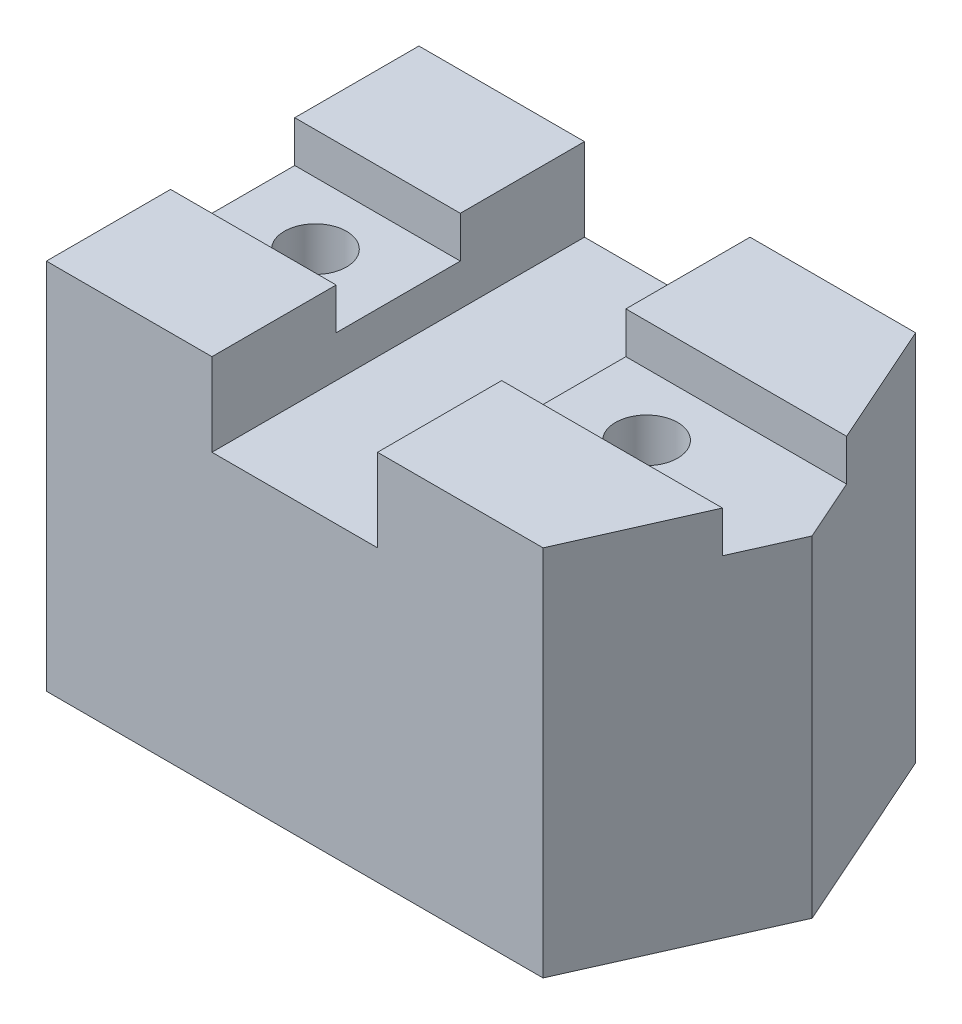
ISO-10303-21;
HEADER;
FILE_DESCRIPTION(('STEP AP214'),'2;1');
FILE_NAME('part.step','',(''),(''),'','','');
FILE_SCHEMA(('AUTOMOTIVE_DESIGN { 1 0 10303 214 1 1 1 1 }'));
ENDSEC;
DATA;
#1=APPLICATION_CONTEXT('core data for automotive mechanical design processes');
#2=APPLICATION_PROTOCOL_DEFINITION('international standard','automotive_design',2000,#1);
#3=PRODUCT_CONTEXT('',#1,'mechanical');
#4=PRODUCT('Part','Part','',(#3));
#5=PRODUCT_RELATED_PRODUCT_CATEGORY('part','',(#4));
#6=PRODUCT_DEFINITION_FORMATION('','',#4);
#7=PRODUCT_DEFINITION_CONTEXT('part definition',#1,'design');
#8=PRODUCT_DEFINITION('design','',#6,#7);
#9=PRODUCT_DEFINITION_SHAPE('','',#8);
#10=(LENGTH_UNIT() NAMED_UNIT(*) SI_UNIT(.MILLI.,.METRE.));
#11=(NAMED_UNIT(*) PLANE_ANGLE_UNIT() SI_UNIT($,.RADIAN.));
#12=(NAMED_UNIT(*) SI_UNIT($,.STERADIAN.) SOLID_ANGLE_UNIT());
#13=UNCERTAINTY_MEASURE_WITH_UNIT(LENGTH_MEASURE(1.E-05),#10,'distance_accuracy_value','');
#14=(GEOMETRIC_REPRESENTATION_CONTEXT(3) GLOBAL_UNCERTAINTY_ASSIGNED_CONTEXT((#13)) GLOBAL_UNIT_ASSIGNED_CONTEXT((#10,
#11,#12)) REPRESENTATION_CONTEXT('',''));
#15=CARTESIAN_POINT('',(0.,0.,0.));
#16=DIRECTION('',(0.,0.,1.));
#17=DIRECTION('',(1.,0.,0.));
#18=AXIS2_PLACEMENT_3D('',#15,#16,#17);
#19=CARTESIAN_POINT('',(0.,114.3,0.));
#20=DIRECTION('',(0.,1.,0.));
#21=DIRECTION('',(0.,0.,1.));
#22=AXIS2_PLACEMENT_3D('',#19,#20,#21);
#23=PLANE('',#22);
#24=DIRECTION('',(0.,0.,1.));
#25=VECTOR('',#24,1.);
#26=CARTESIAN_POINT('',(50.8,114.3,0.));
#27=LINE('',#26,#25);
#28=CARTESIAN_POINT('',(50.8,114.3,-38.1));
#29=VERTEX_POINT('',#28);
#30=CARTESIAN_POINT('',(50.8,114.3,0.));
#31=VERTEX_POINT('',#30);
#32=EDGE_CURVE('E347',#29,#31,#27,.T.);
#33=ORIENTED_EDGE('',*,*,#32,.F.);
#34=DIRECTION('',(1.,0.,0.));
#35=VECTOR('',#34,1.);
#36=CARTESIAN_POINT('',(169.333333333333,114.3,-38.1));
#37=LINE('',#36,#35);
#38=CARTESIAN_POINT('',(0.,114.3,-38.1));
#39=VERTEX_POINT('',#38);
#40=EDGE_CURVE('E228',#39,#29,#37,.T.);
#41=ORIENTED_EDGE('',*,*,#40,.F.);
#42=DIRECTION('',(0.,0.,1.));
#43=VECTOR('',#42,1.);
#44=CARTESIAN_POINT('',(0.,114.3,-114.3));
#45=LINE('',#44,#43);
#46=CARTESIAN_POINT('',(0.,114.3,0.));
#47=VERTEX_POINT('',#46);
#48=EDGE_CURVE('E253',#39,#47,#45,.T.);
#49=ORIENTED_EDGE('',*,*,#48,.T.);
#50=DIRECTION('',(1.,0.,0.));
#51=VECTOR('',#50,1.);
#52=CARTESIAN_POINT('',(0.,114.3,0.));
#53=LINE('',#52,#51);
#54=EDGE_CURVE('E254',#47,#31,#53,.T.);
#55=ORIENTED_EDGE('',*,*,#54,.T.);
#56=EDGE_LOOP('',(#33,#41,#49,#55));
#57=FACE_BOUND('',#56,.T.);
#58=ADVANCED_FACE('F39',(#57),#23,.T.);
#59=CARTESIAN_POINT('',(50.8,114.3,-114.3));
#60=VERTEX_POINT('',#59);
#61=CARTESIAN_POINT('',(50.8,114.3,-76.2));
#62=VERTEX_POINT('',#61);
#63=EDGE_CURVE('E182',#60,#62,#27,.T.);
#64=ORIENTED_EDGE('',*,*,#63,.F.);
#65=DIRECTION('',(-1.,0.,0.));
#66=VECTOR('',#65,1.);
#67=CARTESIAN_POINT('',(152.4,114.3,-114.3));
#68=LINE('',#67,#66);
#69=CARTESIAN_POINT('',(0.,114.3,-114.3));
#70=VERTEX_POINT('',#69);
#71=EDGE_CURVE('E265',#60,#70,#68,.T.);
#72=ORIENTED_EDGE('',*,*,#71,.T.);
#73=CARTESIAN_POINT('',(0.,114.3,-76.2));
#74=VERTEX_POINT('',#73);
#75=EDGE_CURVE('E249',#70,#74,#45,.T.);
#76=ORIENTED_EDGE('',*,*,#75,.T.);
#77=DIRECTION('',(-1.,0.,0.));
#78=VECTOR('',#77,1.);
#79=CARTESIAN_POINT('',(0.,114.3,-76.2));
#80=LINE('',#79,#78);
#81=EDGE_CURVE('E305',#62,#74,#80,.T.);
#82=ORIENTED_EDGE('',*,*,#81,.F.);
#83=EDGE_LOOP('',(#64,#72,#76,#82));
#84=FACE_BOUND('',#83,.T.);
#85=ADVANCED_FACE('F363',(#84),#23,.T.);
#86=CARTESIAN_POINT('',(0.,101.6,0.));
#87=DIRECTION('',(0.,-1.,0.));
#88=DIRECTION('',(0.,0.,-1.));
#89=AXIS2_PLACEMENT_3D('',#86,#87,#88);
#90=PLANE('',#89);
#91=CARTESIAN_POINT('',(25.4,101.6,-57.15));
#92=DIRECTION('',(0.,1.,0.));
#93=DIRECTION('',(0.,0.,1.));
#94=AXIS2_PLACEMENT_3D('',#91,#92,#93);
#95=CIRCLE('',#94,9.525);
#96=CARTESIAN_POINT('',(25.4,101.6,-47.625));
#97=VERTEX_POINT('',#96);
#98=EDGE_CURVE('E401',#97,#97,#95,.T.);
#99=ORIENTED_EDGE('',*,*,#98,.F.);
#100=EDGE_LOOP('',(#99));
#101=FACE_BOUND('',#100,.T.);
#102=DIRECTION('',(1.,0.,0.));
#103=VECTOR('',#102,1.);
#104=CARTESIAN_POINT('',(218.011692498618,101.6,-38.1));
#105=LINE('',#104,#103);
#106=CARTESIAN_POINT('',(0.,101.6,-38.1));
#107=VERTEX_POINT('',#106);
#108=CARTESIAN_POINT('',(50.8,101.6,-38.1));
#109=VERTEX_POINT('',#108);
#110=EDGE_CURVE('E213',#107,#109,#105,.T.);
#111=ORIENTED_EDGE('',*,*,#110,.T.);
#112=DIRECTION('',(0.,0.,-1.));
#113=VECTOR('',#112,1.);
#114=CARTESIAN_POINT('',(50.8,101.6,0.));
#115=LINE('',#114,#113);
#116=CARTESIAN_POINT('',(50.8,101.6,-76.2));
#117=VERTEX_POINT('',#116);
#118=EDGE_CURVE('E204',#109,#117,#115,.T.);
#119=ORIENTED_EDGE('',*,*,#118,.T.);
#120=DIRECTION('',(-1.,0.,0.));
#121=VECTOR('',#120,1.);
#122=CARTESIAN_POINT('',(0.,101.6,-76.2));
#123=LINE('',#122,#121);
#124=CARTESIAN_POINT('',(0.,101.6,-76.2));
#125=VERTEX_POINT('',#124);
#126=EDGE_CURVE('E217',#117,#125,#123,.T.);
#127=ORIENTED_EDGE('',*,*,#126,.T.);
#128=DIRECTION('',(0.,0.,1.));
#129=VECTOR('',#128,1.);
#130=CARTESIAN_POINT('',(0.,101.6,-38.1));
#131=LINE('',#130,#129);
#132=EDGE_CURVE('E223',#125,#107,#131,.T.);
#133=ORIENTED_EDGE('',*,*,#132,.T.);
#134=EDGE_LOOP('',(#111,#119,#127,#133));
#135=FACE_BOUND('',#134,.T.);
#136=ADVANCED_FACE('F389',(#101,#135),#90,.F.);
#137=CARTESIAN_POINT('',(169.333333333333,101.6,-38.1));
#138=DIRECTION('',(0.,0.,1.));
#139=DIRECTION('',(1.,0.,0.));
#140=AXIS2_PLACEMENT_3D('',#137,#138,#139);
#141=PLANE('',#140);
#142=ORIENTED_EDGE('',*,*,#40,.T.);
#143=DIRECTION('',(0.,-1.,0.));
#144=VECTOR('',#143,1.);
#145=CARTESIAN_POINT('',(50.8,101.6,-38.1));
#146=LINE('',#145,#144);
#147=EDGE_CURVE('E208',#29,#109,#146,.T.);
#148=ORIENTED_EDGE('',*,*,#147,.T.);
#149=ORIENTED_EDGE('',*,*,#110,.F.);
#150=DIRECTION('',(0.,1.,0.));
#151=VECTOR('',#150,1.);
#152=CARTESIAN_POINT('',(0.,101.6,-38.1));
#153=LINE('',#152,#151);
#154=EDGE_CURVE('E232',#107,#39,#153,.T.);
#155=ORIENTED_EDGE('',*,*,#154,.T.);
#156=EDGE_LOOP('',(#142,#148,#149,#155));
#157=FACE_BOUND('',#156,.T.);
#158=ADVANCED_FACE('F391',(#157),#141,.F.);
#159=CARTESIAN_POINT('',(0.,101.6,-76.2));
#160=DIRECTION('',(0.,0.,-1.));
#161=DIRECTION('',(-1.,0.,0.));
#162=AXIS2_PLACEMENT_3D('',#159,#160,#161);
#163=PLANE('',#162);
#164=ORIENTED_EDGE('',*,*,#126,.F.);
#165=DIRECTION('',(0.,1.,0.));
#166=VECTOR('',#165,1.);
#167=CARTESIAN_POINT('',(50.8,101.6,-76.2));
#168=LINE('',#167,#166);
#169=EDGE_CURVE('E11',#117,#62,#168,.T.);
#170=ORIENTED_EDGE('',*,*,#169,.T.);
#171=ORIENTED_EDGE('',*,*,#81,.T.);
#172=DIRECTION('',(0.,1.,0.));
#173=VECTOR('',#172,1.);
#174=CARTESIAN_POINT('',(0.,101.6,-76.2));
#175=LINE('',#174,#173);
#176=EDGE_CURVE('E227',#125,#74,#175,.T.);
#177=ORIENTED_EDGE('',*,*,#176,.F.);
#178=EDGE_LOOP('',(#164,#170,#171,#177));
#179=FACE_BOUND('',#178,.T.);
#180=ADVANCED_FACE('F386',(#179),#163,.F.);
#181=DIRECTION('',(0.,0.,-1.));
#182=VECTOR('',#181,1.);
#183=CARTESIAN_POINT('',(101.6,114.3,-114.3));
#184=LINE('',#183,#182);
#185=CARTESIAN_POINT('',(101.6,114.3,0.));
#186=VERTEX_POINT('',#185);
#187=CARTESIAN_POINT('',(101.6,114.3,-38.1));
#188=VERTEX_POINT('',#187);
#189=EDGE_CURVE('E342',#186,#188,#184,.T.);
#190=ORIENTED_EDGE('',*,*,#189,.F.);
#191=CARTESIAN_POINT('',(152.4,114.3,0.));
#192=VERTEX_POINT('',#191);
#193=EDGE_CURVE('E187',#186,#192,#53,.T.);
#194=ORIENTED_EDGE('',*,*,#193,.T.);
#195=DIRECTION('',(0.406138466053447,0.,-0.913811548620257));
#196=VECTOR('',#195,1.);
#197=CARTESIAN_POINT('',(152.4,114.3,0.));
#198=LINE('',#197,#196);
#199=CARTESIAN_POINT('',(169.333333333333,114.3,-38.1));
#200=VERTEX_POINT('',#199);
#201=EDGE_CURVE('E258',#192,#200,#198,.T.);
#202=ORIENTED_EDGE('',*,*,#201,.T.);
#203=EDGE_CURVE('E212',#188,#200,#37,.T.);
#204=ORIENTED_EDGE('',*,*,#203,.F.);
#205=EDGE_LOOP('',(#190,#194,#202,#204));
#206=FACE_BOUND('',#205,.T.);
#207=ADVANCED_FACE('F376',(#206),#23,.T.);
#208=CARTESIAN_POINT('',(0.,114.3,-114.3));
#209=DIRECTION('',(1.,0.,0.));
#210=DIRECTION('',(0.,0.,-1.));
#211=AXIS2_PLACEMENT_3D('',#208,#209,#210);
#212=PLANE('',#211);
#213=ORIENTED_EDGE('',*,*,#48,.F.);
#214=ORIENTED_EDGE('',*,*,#154,.F.);
#215=ORIENTED_EDGE('',*,*,#132,.F.);
#216=ORIENTED_EDGE('',*,*,#176,.T.);
#217=ORIENTED_EDGE('',*,*,#75,.F.);
#218=DIRECTION('',(0.,-1.,0.));
#219=VECTOR('',#218,1.);
#220=CARTESIAN_POINT('',(0.,114.3,-114.3));
#221=LINE('',#220,#219);
#222=CARTESIAN_POINT('',(0.,0.,-114.3));
#223=VERTEX_POINT('',#222);
#224=EDGE_CURVE('E270',#70,#223,#221,.T.);
#225=ORIENTED_EDGE('',*,*,#224,.T.);
#226=DIRECTION('',(0.,0.,1.));
#227=VECTOR('',#226,1.);
#228=CARTESIAN_POINT('',(0.,0.,-114.3));
#229=LINE('',#228,#227);
#230=CARTESIAN_POINT('',(0.,0.,0.));
#231=VERTEX_POINT('',#230);
#232=EDGE_CURVE('E248',#223,#231,#229,.T.);
#233=ORIENTED_EDGE('',*,*,#232,.T.);
#234=DIRECTION('',(0.,-1.,0.));
#235=VECTOR('',#234,1.);
#236=CARTESIAN_POINT('',(0.,114.3,0.));
#237=LINE('',#236,#235);
#238=EDGE_CURVE('E301',#47,#231,#237,.T.);
#239=ORIENTED_EDGE('',*,*,#238,.F.);
#240=EDGE_LOOP('',(#213,#214,#215,#216,#217,#225,#233,#239));
#241=FACE_BOUND('',#240,.T.);
#242=ADVANCED_FACE('F41',(#241),#212,.F.);
#243=CARTESIAN_POINT('',(0.,114.3,0.));
#244=DIRECTION('',(0.,0.,-1.));
#245=DIRECTION('',(-1.,0.,0.));
#246=AXIS2_PLACEMENT_3D('',#243,#244,#245);
#247=PLANE('',#246);
#248=DIRECTION('',(1.,0.,0.));
#249=VECTOR('',#248,1.);
#250=CARTESIAN_POINT('',(101.6,88.9,0.));
#251=LINE('',#250,#249);
#252=CARTESIAN_POINT('',(50.8,88.9,0.));
#253=VERTEX_POINT('',#252);
#254=CARTESIAN_POINT('',(101.6,88.9,0.));
#255=VERTEX_POINT('',#254);
#256=EDGE_CURVE('E172',#253,#255,#251,.T.);
#257=ORIENTED_EDGE('',*,*,#256,.F.);
#258=DIRECTION('',(0.,1.,0.));
#259=VECTOR('',#258,1.);
#260=CARTESIAN_POINT('',(50.8,88.9,0.));
#261=LINE('',#260,#259);
#262=EDGE_CURVE('E200',#253,#31,#261,.T.);
#263=ORIENTED_EDGE('',*,*,#262,.T.);
#264=ORIENTED_EDGE('',*,*,#54,.F.);
#265=ORIENTED_EDGE('',*,*,#238,.T.);
#266=DIRECTION('',(1.,0.,0.));
#267=VECTOR('',#266,1.);
#268=CARTESIAN_POINT('',(0.,0.,0.));
#269=LINE('',#268,#267);
#270=CARTESIAN_POINT('',(152.4,0.,0.));
#271=VERTEX_POINT('',#270);
#272=EDGE_CURVE('E274',#231,#271,#269,.T.);
#273=ORIENTED_EDGE('',*,*,#272,.T.);
#274=DIRECTION('',(0.,-1.,0.));
#275=VECTOR('',#274,1.);
#276=CARTESIAN_POINT('',(152.4,114.3,0.));
#277=LINE('',#276,#275);
#278=EDGE_CURVE('E297',#192,#271,#277,.T.);
#279=ORIENTED_EDGE('',*,*,#278,.F.);
#280=ORIENTED_EDGE('',*,*,#193,.F.);
#281=DIRECTION('',(0.,1.,0.));
#282=VECTOR('',#281,1.);
#283=CARTESIAN_POINT('',(101.6,88.9,0.));
#284=LINE('',#283,#282);
#285=EDGE_CURVE('E164',#255,#186,#284,.T.);
#286=ORIENTED_EDGE('',*,*,#285,.F.);
#287=EDGE_LOOP('',(#257,#263,#264,#265,#273,#279,#280,#286));
#288=FACE_BOUND('',#287,.T.);
#289=ADVANCED_FACE('F185',(#288),#247,.F.);
#290=CARTESIAN_POINT('',(152.4,114.3,0.));
#291=DIRECTION('',(-0.913811548620257,0.,-0.406138466053447));
#292=DIRECTION('',(-0.406138466053447,0.,0.913811548620257));
#293=AXIS2_PLACEMENT_3D('',#290,#291,#292);
#294=PLANE('',#293);
#295=DIRECTION('',(-0.406138466053447,0.,0.913811548620257));
#296=VECTOR('',#295,1.);
#297=CARTESIAN_POINT('',(152.4,101.6,0.));
#298=LINE('',#297,#296);
#299=CARTESIAN_POINT('',(177.8,101.6,-57.15));
#300=VERTEX_POINT('',#299);
#301=CARTESIAN_POINT('',(169.333333333333,101.6,-38.1));
#302=VERTEX_POINT('',#301);
#303=EDGE_CURVE('E244',#300,#302,#298,.T.);
#304=ORIENTED_EDGE('',*,*,#303,.T.);
#305=DIRECTION('',(0.,1.,0.));
#306=VECTOR('',#305,1.);
#307=CARTESIAN_POINT('',(169.333333333333,114.3,-38.1));
#308=LINE('',#307,#306);
#309=EDGE_CURVE('E240',#302,#200,#308,.T.);
#310=ORIENTED_EDGE('',*,*,#309,.T.);
#311=ORIENTED_EDGE('',*,*,#201,.F.);
#312=ORIENTED_EDGE('',*,*,#278,.T.);
#313=DIRECTION('',(0.406138466053447,0.,-0.913811548620257));
#314=VECTOR('',#313,1.);
#315=CARTESIAN_POINT('',(152.4,0.,0.));
#316=LINE('',#315,#314);
#317=CARTESIAN_POINT('',(177.8,0.,-57.15));
#318=VERTEX_POINT('',#317);
#319=EDGE_CURVE('E277',#271,#318,#316,.T.);
#320=ORIENTED_EDGE('',*,*,#319,.T.);
#321=DIRECTION('',(0.,-1.,0.));
#322=VECTOR('',#321,1.);
#323=CARTESIAN_POINT('',(177.8,114.3,-57.15));
#324=LINE('',#323,#322);
#325=EDGE_CURVE('E294',#300,#318,#324,.T.);
#326=ORIENTED_EDGE('',*,*,#325,.F.);
#327=EDGE_LOOP('',(#304,#310,#311,#312,#320,#326));
#328=FACE_BOUND('',#327,.T.);
#329=ADVANCED_FACE('F324',(#328),#294,.F.);
#330=CARTESIAN_POINT('',(177.8,114.3,-57.15));
#331=DIRECTION('',(-0.913811548620257,0.,0.406138466053447));
#332=DIRECTION('',(0.406138466053447,0.,0.913811548620257));
#333=AXIS2_PLACEMENT_3D('',#330,#331,#332);
#334=PLANE('',#333);
#335=DIRECTION('',(-0.406138466053447,0.,-0.913811548620257));
#336=VECTOR('',#335,1.);
#337=CARTESIAN_POINT('',(177.8,114.3,-57.15));
#338=LINE('',#337,#336);
#339=CARTESIAN_POINT('',(169.333333333333,114.3,-76.2));
#340=VERTEX_POINT('',#339);
#341=CARTESIAN_POINT('',(152.4,114.3,-114.3));
#342=VERTEX_POINT('',#341);
#343=EDGE_CURVE('E262',#340,#342,#338,.T.);
#344=ORIENTED_EDGE('',*,*,#343,.F.);
#345=DIRECTION('',(0.,-1.,0.));
#346=VECTOR('',#345,1.);
#347=CARTESIAN_POINT('',(169.333333333333,114.3,-76.2));
#348=LINE('',#347,#346);
#349=CARTESIAN_POINT('',(169.333333333333,101.6,-76.2));
#350=VERTEX_POINT('',#349);
#351=EDGE_CURVE('E64',#340,#350,#348,.T.);
#352=ORIENTED_EDGE('',*,*,#351,.T.);
#353=DIRECTION('',(0.406138466053447,0.,0.913811548620257));
#354=VECTOR('',#353,1.);
#355=CARTESIAN_POINT('',(177.8,101.6,-57.15));
#356=LINE('',#355,#354);
#357=EDGE_CURVE('E309',#350,#300,#356,.T.);
#358=ORIENTED_EDGE('',*,*,#357,.T.);
#359=ORIENTED_EDGE('',*,*,#325,.T.);
#360=DIRECTION('',(-0.406138466053447,0.,-0.913811548620257));
#361=VECTOR('',#360,1.);
#362=CARTESIAN_POINT('',(177.8,0.,-57.15));
#363=LINE('',#362,#361);
#364=CARTESIAN_POINT('',(152.4,0.,-114.3));
#365=VERTEX_POINT('',#364);
#366=EDGE_CURVE('E281',#318,#365,#363,.T.);
#367=ORIENTED_EDGE('',*,*,#366,.T.);
#368=DIRECTION('',(0.,-1.,0.));
#369=VECTOR('',#368,1.);
#370=CARTESIAN_POINT('',(152.4,114.3,-114.3));
#371=LINE('',#370,#369);
#372=EDGE_CURVE('E290',#342,#365,#371,.T.);
#373=ORIENTED_EDGE('',*,*,#372,.F.);
#374=EDGE_LOOP('',(#344,#352,#358,#359,#367,#373));
#375=FACE_BOUND('',#374,.T.);
#376=ADVANCED_FACE('F322',(#375),#334,.F.);
#377=CARTESIAN_POINT('',(152.4,114.3,-114.3));
#378=DIRECTION('',(0.,0.,1.));
#379=DIRECTION('',(1.,0.,0.));
#380=AXIS2_PLACEMENT_3D('',#377,#378,#379);
#381=PLANE('',#380);
#382=ORIENTED_EDGE('',*,*,#71,.F.);
#383=DIRECTION('',(0.,1.,0.));
#384=VECTOR('',#383,1.);
#385=CARTESIAN_POINT('',(50.8,88.9,-114.3));
#386=LINE('',#385,#384);
#387=CARTESIAN_POINT('',(50.8,88.9,-114.3));
#388=VERTEX_POINT('',#387);
#389=EDGE_CURVE('E192',#388,#60,#386,.T.);
#390=ORIENTED_EDGE('',*,*,#389,.F.);
#391=DIRECTION('',(-1.,0.,0.));
#392=VECTOR('',#391,1.);
#393=CARTESIAN_POINT('',(50.8,88.9,-114.3));
#394=LINE('',#393,#392);
#395=CARTESIAN_POINT('',(101.6,88.9,-114.3));
#396=VERTEX_POINT('',#395);
#397=EDGE_CURVE('E171',#396,#388,#394,.T.);
#398=ORIENTED_EDGE('',*,*,#397,.F.);
#399=DIRECTION('',(0.,1.,0.));
#400=VECTOR('',#399,1.);
#401=CARTESIAN_POINT('',(101.6,88.9,-114.3));
#402=LINE('',#401,#400);
#403=CARTESIAN_POINT('',(101.6,114.3,-114.3));
#404=VERTEX_POINT('',#403);
#405=EDGE_CURVE('E167',#396,#404,#402,.T.);
#406=ORIENTED_EDGE('',*,*,#405,.T.);
#407=EDGE_CURVE('E266',#342,#404,#68,.T.);
#408=ORIENTED_EDGE('',*,*,#407,.F.);
#409=ORIENTED_EDGE('',*,*,#372,.T.);
#410=DIRECTION('',(-1.,0.,0.));
#411=VECTOR('',#410,1.);
#412=CARTESIAN_POINT('',(152.4,0.,-114.3));
#413=LINE('',#412,#411);
#414=EDGE_CURVE('E284',#365,#223,#413,.T.);
#415=ORIENTED_EDGE('',*,*,#414,.T.);
#416=ORIENTED_EDGE('',*,*,#224,.F.);
#417=EDGE_LOOP('',(#382,#390,#398,#406,#408,#409,#415,#416));
#418=FACE_BOUND('',#417,.T.);
#419=ADVANCED_FACE('F336',(#418),#381,.F.);
#420=CARTESIAN_POINT('',(101.6,114.3,-76.2));
#421=VERTEX_POINT('',#420);
#422=EDGE_CURVE('E340',#421,#404,#184,.T.);
#423=ORIENTED_EDGE('',*,*,#422,.F.);
#424=EDGE_CURVE('E306',#340,#421,#80,.T.);
#425=ORIENTED_EDGE('',*,*,#424,.F.);
#426=ORIENTED_EDGE('',*,*,#343,.T.);
#427=ORIENTED_EDGE('',*,*,#407,.T.);
#428=EDGE_LOOP('',(#423,#425,#426,#427));
#429=FACE_BOUND('',#428,.T.);
#430=ADVANCED_FACE('F339',(#429),#23,.T.);
#431=CARTESIAN_POINT('',(0.,0.,0.));
#432=DIRECTION('',(0.,1.,0.));
#433=DIRECTION('',(0.,0.,1.));
#434=AXIS2_PLACEMENT_3D('',#431,#432,#433);
#435=PLANE('',#434);
#436=CARTESIAN_POINT('',(25.4,0.,-57.15));
#437=DIRECTION('',(0.,1.,0.));
#438=DIRECTION('',(0.,0.,1.));
#439=AXIS2_PLACEMENT_3D('',#436,#437,#438);
#440=CIRCLE('',#439,9.525);
#441=CARTESIAN_POINT('',(25.4,0.,-47.625));
#442=VERTEX_POINT('',#441);
#443=EDGE_CURVE('E43',#442,#442,#440,.T.);
#444=ORIENTED_EDGE('',*,*,#443,.T.);
#445=EDGE_LOOP('',(#444));
#446=FACE_BOUND('',#445,.T.);
#447=CARTESIAN_POINT('',(127.,0.,-57.15));
#448=DIRECTION('',(0.,1.,0.));
#449=DIRECTION('',(0.,0.,1.));
#450=AXIS2_PLACEMENT_3D('',#447,#448,#449);
#451=CIRCLE('',#450,9.525);
#452=CARTESIAN_POINT('',(127.,0.,-47.625));
#453=VERTEX_POINT('',#452);
#454=EDGE_CURVE('E343',#453,#453,#451,.T.);
#455=ORIENTED_EDGE('',*,*,#454,.T.);
#456=EDGE_LOOP('',(#455));
#457=FACE_BOUND('',#456,.T.);
#458=ORIENTED_EDGE('',*,*,#232,.F.);
#459=ORIENTED_EDGE('',*,*,#414,.F.);
#460=ORIENTED_EDGE('',*,*,#366,.F.);
#461=ORIENTED_EDGE('',*,*,#319,.F.);
#462=ORIENTED_EDGE('',*,*,#272,.F.);
#463=EDGE_LOOP('',(#458,#459,#460,#461,#462));
#464=FACE_BOUND('',#463,.T.);
#465=ADVANCED_FACE('F331',(#446,#457,#464),#435,.F.);
#466=CARTESIAN_POINT('',(127.,101.6,-57.15));
#467=DIRECTION('',(0.,1.,0.));
#468=DIRECTION('',(0.,0.,1.));
#469=AXIS2_PLACEMENT_3D('',#466,#467,#468);
#470=CIRCLE('',#469,9.525);
#471=CARTESIAN_POINT('',(127.,101.6,-47.625));
#472=VERTEX_POINT('',#471);
#473=EDGE_CURVE('E349',#472,#472,#470,.T.);
#474=ORIENTED_EDGE('',*,*,#473,.F.);
#475=EDGE_LOOP('',(#474));
#476=FACE_BOUND('',#475,.T.);
#477=CARTESIAN_POINT('',(101.6,101.6,-76.2));
#478=VERTEX_POINT('',#477);
#479=EDGE_CURVE('E219',#350,#478,#123,.T.);
#480=ORIENTED_EDGE('',*,*,#479,.T.);
#481=DIRECTION('',(0.,0.,1.));
#482=VECTOR('',#481,1.);
#483=CARTESIAN_POINT('',(101.6,101.6,0.));
#484=LINE('',#483,#482);
#485=CARTESIAN_POINT('',(101.6,101.6,-38.1));
#486=VERTEX_POINT('',#485);
#487=EDGE_CURVE('E56',#478,#486,#484,.T.);
#488=ORIENTED_EDGE('',*,*,#487,.T.);
#489=EDGE_CURVE('E218',#486,#302,#105,.T.);
#490=ORIENTED_EDGE('',*,*,#489,.T.);
#491=ORIENTED_EDGE('',*,*,#303,.F.);
#492=ORIENTED_EDGE('',*,*,#357,.F.);
#493=EDGE_LOOP('',(#480,#488,#490,#491,#492));
#494=FACE_BOUND('',#493,.T.);
#495=ADVANCED_FACE('F317',(#476,#494),#90,.F.);
#496=ORIENTED_EDGE('',*,*,#489,.F.);
#497=DIRECTION('',(0.,1.,0.));
#498=VECTOR('',#497,1.);
#499=CARTESIAN_POINT('',(101.6,101.6,-38.1));
#500=LINE('',#499,#498);
#501=EDGE_CURVE('E199',#486,#188,#500,.T.);
#502=ORIENTED_EDGE('',*,*,#501,.T.);
#503=ORIENTED_EDGE('',*,*,#203,.T.);
#504=ORIENTED_EDGE('',*,*,#309,.F.);
#505=EDGE_LOOP('',(#496,#502,#503,#504));
#506=FACE_BOUND('',#505,.T.);
#507=ADVANCED_FACE('F374',(#506),#141,.F.);
#508=ORIENTED_EDGE('',*,*,#424,.T.);
#509=DIRECTION('',(0.,-1.,0.));
#510=VECTOR('',#509,1.);
#511=CARTESIAN_POINT('',(101.6,101.6,-76.2));
#512=LINE('',#511,#510);
#513=EDGE_CURVE('E49',#421,#478,#512,.T.);
#514=ORIENTED_EDGE('',*,*,#513,.T.);
#515=ORIENTED_EDGE('',*,*,#479,.F.);
#516=ORIENTED_EDGE('',*,*,#351,.F.);
#517=EDGE_LOOP('',(#508,#514,#515,#516));
#518=FACE_BOUND('',#517,.T.);
#519=ADVANCED_FACE('F314',(#518),#163,.F.);
#520=CARTESIAN_POINT('',(50.8,88.9,0.));
#521=DIRECTION('',(-1.,0.,0.));
#522=DIRECTION('',(0.,0.,1.));
#523=AXIS2_PLACEMENT_3D('',#520,#521,#522);
#524=PLANE('',#523);
#525=ORIENTED_EDGE('',*,*,#32,.T.);
#526=ORIENTED_EDGE('',*,*,#262,.F.);
#527=DIRECTION('',(0.,0.,1.));
#528=VECTOR('',#527,1.);
#529=CARTESIAN_POINT('',(50.8,88.9,0.));
#530=LINE('',#529,#528);
#531=EDGE_CURVE('E178',#388,#253,#530,.T.);
#532=ORIENTED_EDGE('',*,*,#531,.F.);
#533=ORIENTED_EDGE('',*,*,#389,.T.);
#534=ORIENTED_EDGE('',*,*,#63,.T.);
#535=ORIENTED_EDGE('',*,*,#169,.F.);
#536=ORIENTED_EDGE('',*,*,#118,.F.);
#537=ORIENTED_EDGE('',*,*,#147,.F.);
#538=EDGE_LOOP('',(#525,#526,#532,#533,#534,#535,#536,#537));
#539=FACE_BOUND('',#538,.T.);
#540=ADVANCED_FACE('F360',(#539),#524,.F.);
#541=CARTESIAN_POINT('',(101.6,88.9,-114.3));
#542=DIRECTION('',(1.,0.,0.));
#543=DIRECTION('',(0.,0.,-1.));
#544=AXIS2_PLACEMENT_3D('',#541,#542,#543);
#545=PLANE('',#544);
#546=ORIENTED_EDGE('',*,*,#487,.F.);
#547=ORIENTED_EDGE('',*,*,#513,.F.);
#548=ORIENTED_EDGE('',*,*,#422,.T.);
#549=ORIENTED_EDGE('',*,*,#405,.F.);
#550=DIRECTION('',(0.,0.,-1.));
#551=VECTOR('',#550,1.);
#552=CARTESIAN_POINT('',(101.6,88.9,-114.3));
#553=LINE('',#552,#551);
#554=EDGE_CURVE('E160',#255,#396,#553,.T.);
#555=ORIENTED_EDGE('',*,*,#554,.F.);
#556=ORIENTED_EDGE('',*,*,#285,.T.);
#557=ORIENTED_EDGE('',*,*,#189,.T.);
#558=ORIENTED_EDGE('',*,*,#501,.F.);
#559=EDGE_LOOP('',(#546,#547,#548,#549,#555,#556,#557,#558));
#560=FACE_BOUND('',#559,.T.);
#561=ADVANCED_FACE('F162',(#560),#545,.F.);
#562=CARTESIAN_POINT('',(0.,88.9,0.));
#563=DIRECTION('',(0.,-1.,0.));
#564=DIRECTION('',(0.,0.,-1.));
#565=AXIS2_PLACEMENT_3D('',#562,#563,#564);
#566=PLANE('',#565);
#567=ORIENTED_EDGE('',*,*,#256,.T.);
#568=ORIENTED_EDGE('',*,*,#554,.T.);
#569=ORIENTED_EDGE('',*,*,#397,.T.);
#570=ORIENTED_EDGE('',*,*,#531,.T.);
#571=EDGE_LOOP('',(#567,#568,#569,#570));
#572=FACE_BOUND('',#571,.T.);
#573=ADVANCED_FACE('F176',(#572),#566,.F.);
#574=CARTESIAN_POINT('',(127.,-2184.4,-57.15));
#575=DIRECTION('',(0.,1.,0.));
#576=DIRECTION('',(0.,0.,1.));
#577=AXIS2_PLACEMENT_3D('',#574,#575,#576);
#578=CYLINDRICAL_SURFACE('',#577,9.525);
#579=ORIENTED_EDGE('',*,*,#473,.T.);
#580=EDGE_LOOP('',(#579));
#581=FACE_BOUND('',#580,.T.);
#582=ORIENTED_EDGE('',*,*,#454,.F.);
#583=EDGE_LOOP('',(#582));
#584=FACE_BOUND('',#583,.T.);
#585=ADVANCED_FACE('F414',(#581,#584),#578,.F.);
#586=CARTESIAN_POINT('',(25.4,-2184.4,-57.15));
#587=DIRECTION('',(0.,1.,0.));
#588=DIRECTION('',(0.,0.,1.));
#589=AXIS2_PLACEMENT_3D('',#586,#587,#588);
#590=CYLINDRICAL_SURFACE('',#589,9.525);
#591=ORIENTED_EDGE('',*,*,#98,.T.);
#592=EDGE_LOOP('',(#591));
#593=FACE_BOUND('',#592,.T.);
#594=ORIENTED_EDGE('',*,*,#443,.F.);
#595=EDGE_LOOP('',(#594));
#596=FACE_BOUND('',#595,.T.);
#597=ADVANCED_FACE('F412',(#593,#596),#590,.F.);
#598=CLOSED_SHELL('',(#58,#85,#136,#158,#180,#207,#242,#289,#329,#376,#419,#430,#465,#495,#507,
#519,#540,#561,#573,#585,#597));
#599=MANIFOLD_SOLID_BREP('B2',#598);
#600=ADVANCED_BREP_SHAPE_REPRESENTATION('',(#18,#599),#14);
#601=SHAPE_DEFINITION_REPRESENTATION(#9,#600);
ENDSEC;
END-ISO-10303-21;
